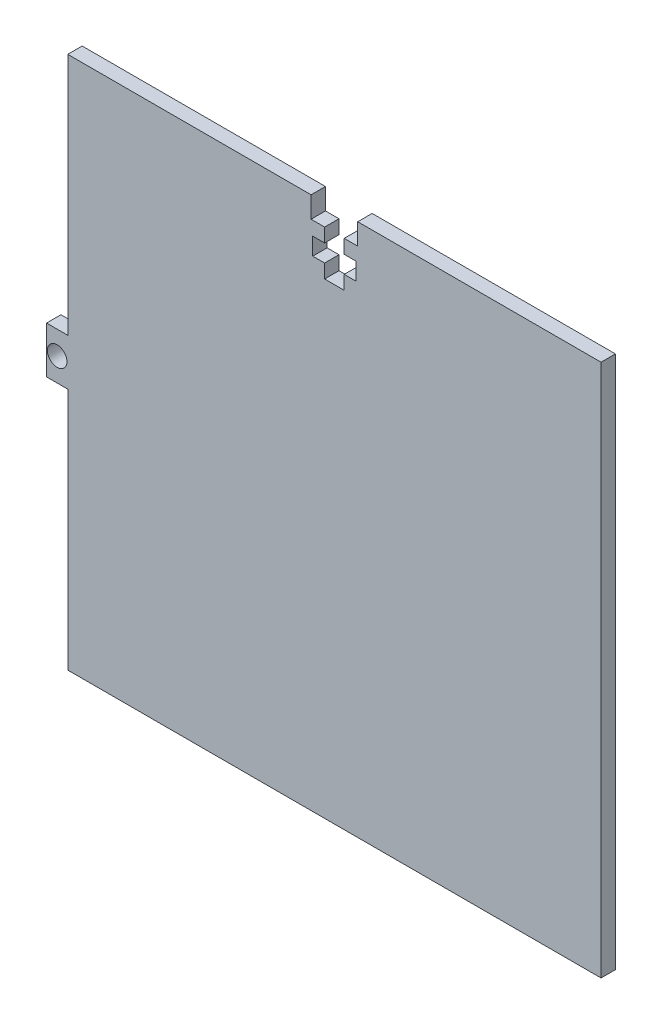
ISO-10303-21;
HEADER;
FILE_DESCRIPTION(('STEP AP214'),'2;1');
FILE_NAME('part.step','',(''),(''),'','','');
FILE_SCHEMA(('AUTOMOTIVE_DESIGN { 1 0 10303 214 1 1 1 1 }'));
ENDSEC;
DATA;
#1=APPLICATION_CONTEXT('core data for automotive mechanical design processes');
#2=APPLICATION_PROTOCOL_DEFINITION('international standard','automotive_design',2000,#1);
#3=PRODUCT_CONTEXT('',#1,'mechanical');
#4=PRODUCT('Part','Part','',(#3));
#5=PRODUCT_RELATED_PRODUCT_CATEGORY('part','',(#4));
#6=PRODUCT_DEFINITION_FORMATION('','',#4);
#7=PRODUCT_DEFINITION_CONTEXT('part definition',#1,'design');
#8=PRODUCT_DEFINITION('design','',#6,#7);
#9=PRODUCT_DEFINITION_SHAPE('','',#8);
#10=(LENGTH_UNIT() NAMED_UNIT(*) SI_UNIT(.MILLI.,.METRE.));
#11=(NAMED_UNIT(*) PLANE_ANGLE_UNIT() SI_UNIT($,.RADIAN.));
#12=(NAMED_UNIT(*) SI_UNIT($,.STERADIAN.) SOLID_ANGLE_UNIT());
#13=UNCERTAINTY_MEASURE_WITH_UNIT(LENGTH_MEASURE(1.E-05),#10,'distance_accuracy_value','');
#14=(GEOMETRIC_REPRESENTATION_CONTEXT(3) GLOBAL_UNCERTAINTY_ASSIGNED_CONTEXT((#13)) GLOBAL_UNIT_ASSIGNED_CONTEXT((#10,
#11,#12)) REPRESENTATION_CONTEXT('',''));
#15=CARTESIAN_POINT('',(0.,0.,0.));
#16=DIRECTION('',(0.,0.,1.));
#17=DIRECTION('',(1.,0.,0.));
#18=AXIS2_PLACEMENT_3D('',#15,#16,#17);
#19=CARTESIAN_POINT('',(-40.,40.,2.15880724650714));
#20=DIRECTION('',(1.,0.,0.));
#21=DIRECTION('',(0.,1.,0.));
#22=AXIS2_PLACEMENT_3D('',#19,#20,#21);
#23=PLANE('',#22);
#24=DIRECTION('',(0.,0.,1.));
#25=VECTOR('',#24,1.);
#26=CARTESIAN_POINT('',(-40.,-3.50000000000002,-7.68845888328736));
#27=LINE('',#26,#25);
#28=CARTESIAN_POINT('',(-40.,-3.50000000000002,0.));
#29=VERTEX_POINT('',#28);
#30=CARTESIAN_POINT('',(-40.,-3.50000000000002,2.15880724650714));
#31=VERTEX_POINT('',#30);
#32=EDGE_CURVE('E61',#29,#31,#27,.T.);
#33=ORIENTED_EDGE('',*,*,#32,.F.);
#34=DIRECTION('',(0.,-1.,0.));
#35=VECTOR('',#34,1.);
#36=CARTESIAN_POINT('',(-40.,40.,0.));
#37=LINE('',#36,#35);
#38=CARTESIAN_POINT('',(-40.,-40.,0.));
#39=VERTEX_POINT('',#38);
#40=EDGE_CURVE('E381',#29,#39,#37,.T.);
#41=ORIENTED_EDGE('',*,*,#40,.T.);
#42=DIRECTION('',(0.,0.,-1.));
#43=VECTOR('',#42,1.);
#44=CARTESIAN_POINT('',(-40.,-40.,2.15880724650714));
#45=LINE('',#44,#43);
#46=CARTESIAN_POINT('',(-40.,-40.,2.15880724650714));
#47=VERTEX_POINT('',#46);
#48=EDGE_CURVE('E387',#47,#39,#45,.T.);
#49=ORIENTED_EDGE('',*,*,#48,.F.);
#50=DIRECTION('',(0.,-1.,0.));
#51=VECTOR('',#50,1.);
#52=CARTESIAN_POINT('',(-40.,40.,2.15880724650714));
#53=LINE('',#52,#51);
#54=EDGE_CURVE('E370',#31,#47,#53,.T.);
#55=ORIENTED_EDGE('',*,*,#54,.F.);
#56=EDGE_LOOP('',(#33,#41,#49,#55));
#57=FACE_BOUND('',#56,.T.);
#58=ADVANCED_FACE('F38',(#57),#23,.F.);
#59=CARTESIAN_POINT('',(-3.5,36.825,0.));
#60=DIRECTION('',(0.,-1.,0.));
#61=DIRECTION('',(1.,0.,0.));
#62=AXIS2_PLACEMENT_3D('',#59,#60,#61);
#63=PLANE('',#62);
#64=DIRECTION('',(1.,0.,0.));
#65=VECTOR('',#64,1.);
#66=CARTESIAN_POINT('',(-3.5,36.825,2.15880724650714));
#67=LINE('',#66,#65);
#68=CARTESIAN_POINT('',(-3.5,36.825,2.15880724650714));
#69=VERTEX_POINT('',#68);
#70=CARTESIAN_POINT('',(-1.47,36.825,2.15880724650714));
#71=VERTEX_POINT('',#70);
#72=EDGE_CURVE('E346',#69,#71,#67,.T.);
#73=ORIENTED_EDGE('',*,*,#72,.T.);
#74=DIRECTION('',(0.,0.,1.));
#75=VECTOR('',#74,1.);
#76=CARTESIAN_POINT('',(-1.47,36.825,0.));
#77=LINE('',#76,#75);
#78=CARTESIAN_POINT('',(-1.47,36.825,0.));
#79=VERTEX_POINT('',#78);
#80=EDGE_CURVE('E305',#79,#71,#77,.T.);
#81=ORIENTED_EDGE('',*,*,#80,.F.);
#82=DIRECTION('',(1.,0.,0.));
#83=VECTOR('',#82,1.);
#84=CARTESIAN_POINT('',(-3.5,36.825,0.));
#85=LINE('',#84,#83);
#86=CARTESIAN_POINT('',(-3.5,36.825,0.));
#87=VERTEX_POINT('',#86);
#88=EDGE_CURVE('E335',#87,#79,#85,.T.);
#89=ORIENTED_EDGE('',*,*,#88,.F.);
#90=DIRECTION('',(0.,0.,1.));
#91=VECTOR('',#90,1.);
#92=CARTESIAN_POINT('',(-3.5,36.825,0.));
#93=LINE('',#92,#91);
#94=EDGE_CURVE('E341',#87,#69,#93,.T.);
#95=ORIENTED_EDGE('',*,*,#94,.T.);
#96=EDGE_LOOP('',(#73,#81,#89,#95));
#97=FACE_BOUND('',#96,.T.);
#98=ADVANCED_FACE('F472',(#97),#63,.F.);
#99=CARTESIAN_POINT('',(-40.,40.,2.15880724650714));
#100=DIRECTION('',(0.,-1.,0.));
#101=DIRECTION('',(0.,0.,-1.));
#102=AXIS2_PLACEMENT_3D('',#99,#100,#101);
#103=PLANE('',#102);
#104=DIRECTION('',(-1.,0.,0.));
#105=VECTOR('',#104,1.);
#106=CARTESIAN_POINT('',(-40.,40.,2.15880724650714));
#107=LINE('',#106,#105);
#108=CARTESIAN_POINT('',(-3.50000000000001,40.,2.15880724650714));
#109=VERTEX_POINT('',#108);
#110=CARTESIAN_POINT('',(-40.,40.,2.15880724650714));
#111=VERTEX_POINT('',#110);
#112=EDGE_CURVE('E365',#109,#111,#107,.T.);
#113=ORIENTED_EDGE('',*,*,#112,.F.);
#114=DIRECTION('',(0.,0.,1.));
#115=VECTOR('',#114,1.);
#116=CARTESIAN_POINT('',(-3.50000000000001,40.,0.));
#117=LINE('',#116,#115);
#118=CARTESIAN_POINT('',(-3.50000000000001,40.,0.));
#119=VERTEX_POINT('',#118);
#120=EDGE_CURVE('E352',#119,#109,#117,.T.);
#121=ORIENTED_EDGE('',*,*,#120,.F.);
#122=DIRECTION('',(-1.,0.,0.));
#123=VECTOR('',#122,1.);
#124=CARTESIAN_POINT('',(-40.,40.,0.));
#125=LINE('',#124,#123);
#126=CARTESIAN_POINT('',(-40.,40.,0.));
#127=VERTEX_POINT('',#126);
#128=EDGE_CURVE('E377',#119,#127,#125,.T.);
#129=ORIENTED_EDGE('',*,*,#128,.T.);
#130=DIRECTION('',(0.,0.,-1.));
#131=VECTOR('',#130,1.);
#132=CARTESIAN_POINT('',(-40.,40.,2.15880724650714));
#133=LINE('',#132,#131);
#134=EDGE_CURVE('E46',#111,#127,#133,.T.);
#135=ORIENTED_EDGE('',*,*,#134,.F.);
#136=EDGE_LOOP('',(#113,#121,#129,#135));
#137=FACE_BOUND('',#136,.T.);
#138=ADVANCED_FACE('F477',(#137),#103,.F.);
#139=CARTESIAN_POINT('',(40.,40.,2.15880724650714));
#140=DIRECTION('',(-1.,0.,0.));
#141=DIRECTION('',(0.,-1.,0.));
#142=AXIS2_PLACEMENT_3D('',#139,#140,#141);
#143=PLANE('',#142);
#144=DIRECTION('',(0.,1.,0.));
#145=VECTOR('',#144,1.);
#146=CARTESIAN_POINT('',(40.,40.,0.));
#147=LINE('',#146,#145);
#148=CARTESIAN_POINT('',(40.,-40.,0.));
#149=VERTEX_POINT('',#148);
#150=CARTESIAN_POINT('',(40.,40.,0.));
#151=VERTEX_POINT('',#150);
#152=EDGE_CURVE('E354',#149,#151,#147,.T.);
#153=ORIENTED_EDGE('',*,*,#152,.T.);
#154=DIRECTION('',(0.,0.,-1.));
#155=VECTOR('',#154,1.);
#156=CARTESIAN_POINT('',(40.,40.,2.15880724650714));
#157=LINE('',#156,#155);
#158=CARTESIAN_POINT('',(40.,40.,2.15880724650714));
#159=VERTEX_POINT('',#158);
#160=EDGE_CURVE('E11',#159,#151,#157,.T.);
#161=ORIENTED_EDGE('',*,*,#160,.F.);
#162=DIRECTION('',(0.,1.,0.));
#163=VECTOR('',#162,1.);
#164=CARTESIAN_POINT('',(40.,40.,2.15880724650714));
#165=LINE('',#164,#163);
#166=CARTESIAN_POINT('',(40.,-40.,2.15880724650714));
#167=VERTEX_POINT('',#166);
#168=EDGE_CURVE('E362',#167,#159,#165,.T.);
#169=ORIENTED_EDGE('',*,*,#168,.F.);
#170=DIRECTION('',(0.,0.,-1.));
#171=VECTOR('',#170,1.);
#172=CARTESIAN_POINT('',(40.,-40.,2.15880724650714));
#173=LINE('',#172,#171);
#174=EDGE_CURVE('E374',#167,#149,#173,.T.);
#175=ORIENTED_EDGE('',*,*,#174,.T.);
#176=EDGE_LOOP('',(#153,#161,#169,#175));
#177=FACE_BOUND('',#176,.T.);
#178=ADVANCED_FACE('F40',(#177),#143,.F.);
#179=CARTESIAN_POINT('',(3.50000000000001,40.,0.));
#180=VERTEX_POINT('',#179);
#181=EDGE_CURVE('E378',#151,#180,#125,.T.);
#182=ORIENTED_EDGE('',*,*,#181,.T.);
#183=DIRECTION('',(0.,0.,1.));
#184=VECTOR('',#183,1.);
#185=CARTESIAN_POINT('',(3.50000000000001,40.,0.));
#186=LINE('',#185,#184);
#187=CARTESIAN_POINT('',(3.50000000000001,40.,2.15880724650714));
#188=VERTEX_POINT('',#187);
#189=EDGE_CURVE('E355',#180,#188,#186,.T.);
#190=ORIENTED_EDGE('',*,*,#189,.T.);
#191=EDGE_CURVE('E367',#159,#188,#107,.T.);
#192=ORIENTED_EDGE('',*,*,#191,.F.);
#193=ORIENTED_EDGE('',*,*,#160,.T.);
#194=EDGE_LOOP('',(#182,#190,#192,#193));
#195=FACE_BOUND('',#194,.T.);
#196=ADVANCED_FACE('F418',(#195),#103,.F.);
#197=CARTESIAN_POINT('',(-40.,3.5,0.));
#198=VERTEX_POINT('',#197);
#199=EDGE_CURVE('E382',#127,#198,#37,.T.);
#200=ORIENTED_EDGE('',*,*,#199,.T.);
#201=DIRECTION('',(0.,0.,1.));
#202=VECTOR('',#201,1.);
#203=CARTESIAN_POINT('',(-40.,3.5,-7.68845888328736));
#204=LINE('',#203,#202);
#205=CARTESIAN_POINT('',(-40.,3.5,2.15880724650714));
#206=VERTEX_POINT('',#205);
#207=EDGE_CURVE('E53',#198,#206,#204,.T.);
#208=ORIENTED_EDGE('',*,*,#207,.T.);
#209=EDGE_CURVE('E224',#111,#206,#53,.T.);
#210=ORIENTED_EDGE('',*,*,#209,.F.);
#211=ORIENTED_EDGE('',*,*,#134,.T.);
#212=EDGE_LOOP('',(#200,#208,#210,#211));
#213=FACE_BOUND('',#212,.T.);
#214=ADVANCED_FACE('F392',(#213),#23,.F.);
#215=CARTESIAN_POINT('',(-40.,-40.,2.15880724650714));
#216=DIRECTION('',(0.,1.,0.));
#217=DIRECTION('',(0.,0.,1.));
#218=AXIS2_PLACEMENT_3D('',#215,#216,#217);
#219=PLANE('',#218);
#220=DIRECTION('',(1.,0.,0.));
#221=VECTOR('',#220,1.);
#222=CARTESIAN_POINT('',(-40.,-40.,0.));
#223=LINE('',#222,#221);
#224=EDGE_CURVE('E366',#39,#149,#223,.T.);
#225=ORIENTED_EDGE('',*,*,#224,.T.);
#226=ORIENTED_EDGE('',*,*,#174,.F.);
#227=DIRECTION('',(1.,0.,0.));
#228=VECTOR('',#227,1.);
#229=CARTESIAN_POINT('',(-40.,-40.,2.15880724650714));
#230=LINE('',#229,#228);
#231=EDGE_CURVE('E372',#47,#167,#230,.T.);
#232=ORIENTED_EDGE('',*,*,#231,.F.);
#233=ORIENTED_EDGE('',*,*,#48,.T.);
#234=EDGE_LOOP('',(#225,#226,#232,#233));
#235=FACE_BOUND('',#234,.T.);
#236=ADVANCED_FACE('F410',(#235),#219,.F.);
#237=CARTESIAN_POINT('',(0.,0.,2.15880724650714));
#238=DIRECTION('',(0.,0.,1.));
#239=DIRECTION('',(1.,0.,0.));
#240=AXIS2_PLACEMENT_3D('',#237,#238,#239);
#241=PLANE('',#240);
#242=DIRECTION('',(0.,-1.,0.));
#243=VECTOR('',#242,1.);
#244=CARTESIAN_POINT('',(-1.47,36.825,2.15880724650714));
#245=LINE('',#244,#243);
#246=CARTESIAN_POINT('',(-1.47,34.75,2.15880724650714));
#247=VERTEX_POINT('',#246);
#248=EDGE_CURVE('E239',#71,#247,#245,.T.);
#249=ORIENTED_EDGE('',*,*,#248,.F.);
#250=ORIENTED_EDGE('',*,*,#72,.F.);
#251=DIRECTION('',(0.,-1.,0.));
#252=VECTOR('',#251,1.);
#253=CARTESIAN_POINT('',(-3.50000000000001,40.,2.15880724650714));
#254=LINE('',#253,#252);
#255=EDGE_CURVE('E307',#109,#69,#254,.T.);
#256=ORIENTED_EDGE('',*,*,#255,.F.);
#257=ORIENTED_EDGE('',*,*,#112,.T.);
#258=ORIENTED_EDGE('',*,*,#209,.T.);
#259=DIRECTION('',(-1.,0.,0.));
#260=VECTOR('',#259,1.);
#261=CARTESIAN_POINT('',(-40.,3.5,2.15880724650714));
#262=LINE('',#261,#260);
#263=CARTESIAN_POINT('',(-43.18,3.5,2.15880724650714));
#264=VERTEX_POINT('',#263);
#265=EDGE_CURVE('E205',#206,#264,#262,.T.);
#266=ORIENTED_EDGE('',*,*,#265,.T.);
#267=DIRECTION('',(0.,-1.,0.));
#268=VECTOR('',#267,1.);
#269=CARTESIAN_POINT('',(-43.18,3.5,2.15880724650714));
#270=LINE('',#269,#268);
#271=CARTESIAN_POINT('',(-43.18,-3.5,2.15880724650714));
#272=VERTEX_POINT('',#271);
#273=EDGE_CURVE('E213',#264,#272,#270,.T.);
#274=ORIENTED_EDGE('',*,*,#273,.T.);
#275=DIRECTION('',(1.,0.,0.));
#276=VECTOR('',#275,1.);
#277=CARTESIAN_POINT('',(-40.,-3.50000000000002,2.15880724650714));
#278=LINE('',#277,#276);
#279=EDGE_CURVE('E219',#272,#31,#278,.T.);
#280=ORIENTED_EDGE('',*,*,#279,.T.);
#281=ORIENTED_EDGE('',*,*,#54,.T.);
#282=ORIENTED_EDGE('',*,*,#231,.T.);
#283=ORIENTED_EDGE('',*,*,#168,.T.);
#284=ORIENTED_EDGE('',*,*,#191,.T.);
#285=DIRECTION('',(0.,1.,0.));
#286=VECTOR('',#285,1.);
#287=CARTESIAN_POINT('',(3.50000000000001,40.,2.15880724650714));
#288=LINE('',#287,#286);
#289=CARTESIAN_POINT('',(3.5,36.825,2.15880724650714));
#290=VERTEX_POINT('',#289);
#291=EDGE_CURVE('E334',#290,#188,#288,.T.);
#292=ORIENTED_EDGE('',*,*,#291,.F.);
#293=CARTESIAN_POINT('',(1.47,36.825,2.15880724650714));
#294=VERTEX_POINT('',#293);
#295=EDGE_CURVE('E345',#294,#290,#67,.T.);
#296=ORIENTED_EDGE('',*,*,#295,.F.);
#297=DIRECTION('',(0.,1.,0.));
#298=VECTOR('',#297,1.);
#299=CARTESIAN_POINT('',(1.47,36.825,2.15880724650714));
#300=LINE('',#299,#298);
#301=CARTESIAN_POINT('',(1.47,34.75,2.15880724650714));
#302=VERTEX_POINT('',#301);
#303=EDGE_CURVE('E244',#302,#294,#300,.T.);
#304=ORIENTED_EDGE('',*,*,#303,.F.);
#305=DIRECTION('',(-1.,0.,0.));
#306=VECTOR('',#305,1.);
#307=CARTESIAN_POINT('',(1.47,34.75,2.15880724650714));
#308=LINE('',#307,#306);
#309=CARTESIAN_POINT('',(3.25,34.75,2.15880724650714));
#310=VERTEX_POINT('',#309);
#311=EDGE_CURVE('E301',#310,#302,#308,.T.);
#312=ORIENTED_EDGE('',*,*,#311,.F.);
#313=DIRECTION('',(0.,1.,0.));
#314=VECTOR('',#313,1.);
#315=CARTESIAN_POINT('',(3.25,34.75,2.15880724650714));
#316=LINE('',#315,#314);
#317=CARTESIAN_POINT('',(3.25,32.15,2.15880724650714));
#318=VERTEX_POINT('',#317);
#319=EDGE_CURVE('E298',#318,#310,#316,.T.);
#320=ORIENTED_EDGE('',*,*,#319,.F.);
#321=DIRECTION('',(1.,0.,0.));
#322=VECTOR('',#321,1.);
#323=CARTESIAN_POINT('',(1.47,32.15,2.15880724650714));
#324=LINE('',#323,#322);
#325=CARTESIAN_POINT('',(1.47,32.15,2.15880724650714));
#326=VERTEX_POINT('',#325);
#327=EDGE_CURVE('E295',#326,#318,#324,.T.);
#328=ORIENTED_EDGE('',*,*,#327,.F.);
#329=DIRECTION('',(0.,1.,0.));
#330=VECTOR('',#329,1.);
#331=CARTESIAN_POINT('',(1.47,32.15,2.15880724650714));
#332=LINE('',#331,#330);
#333=CARTESIAN_POINT('',(1.47,30.075,2.15880724650714));
#334=VERTEX_POINT('',#333);
#335=EDGE_CURVE('E292',#334,#326,#332,.T.);
#336=ORIENTED_EDGE('',*,*,#335,.F.);
#337=DIRECTION('',(1.,0.,0.));
#338=VECTOR('',#337,1.);
#339=CARTESIAN_POINT('',(-1.47,30.075,2.15880724650714));
#340=LINE('',#339,#338);
#341=CARTESIAN_POINT('',(-1.47,30.075,2.15880724650714));
#342=VERTEX_POINT('',#341);
#343=EDGE_CURVE('E289',#342,#334,#340,.T.);
#344=ORIENTED_EDGE('',*,*,#343,.F.);
#345=DIRECTION('',(0.,-1.,0.));
#346=VECTOR('',#345,1.);
#347=CARTESIAN_POINT('',(-1.47,32.15,2.15880724650714));
#348=LINE('',#347,#346);
#349=CARTESIAN_POINT('',(-1.47,32.15,2.15880724650714));
#350=VERTEX_POINT('',#349);
#351=EDGE_CURVE('E286',#350,#342,#348,.T.);
#352=ORIENTED_EDGE('',*,*,#351,.F.);
#353=DIRECTION('',(1.,0.,0.));
#354=VECTOR('',#353,1.);
#355=CARTESIAN_POINT('',(-3.25,32.15,2.15880724650714));
#356=LINE('',#355,#354);
#357=CARTESIAN_POINT('',(-3.25,32.15,2.15880724650714));
#358=VERTEX_POINT('',#357);
#359=EDGE_CURVE('E283',#358,#350,#356,.T.);
#360=ORIENTED_EDGE('',*,*,#359,.F.);
#361=DIRECTION('',(0.,-1.,0.));
#362=VECTOR('',#361,1.);
#363=CARTESIAN_POINT('',(-3.25,34.75,2.15880724650714));
#364=LINE('',#363,#362);
#365=CARTESIAN_POINT('',(-3.25,34.75,2.15880724650714));
#366=VERTEX_POINT('',#365);
#367=EDGE_CURVE('E280',#366,#358,#364,.T.);
#368=ORIENTED_EDGE('',*,*,#367,.F.);
#369=DIRECTION('',(-1.,0.,0.));
#370=VECTOR('',#369,1.);
#371=CARTESIAN_POINT('',(-3.25,34.75,2.15880724650714));
#372=LINE('',#371,#370);
#373=EDGE_CURVE('E277',#247,#366,#372,.T.);
#374=ORIENTED_EDGE('',*,*,#373,.F.);
#375=EDGE_LOOP('',(#249,#250,#256,#257,#258,#266,#274,#280,#281,#282,#283,#284,#292,#296,#304,
#312,#320,#328,#336,#344,#352,#360,#368,#374));
#376=FACE_BOUND('',#375,.T.);
#377=CARTESIAN_POINT('',(-41.59,0.,2.15880724650714));
#378=DIRECTION('',(0.,0.,1.));
#379=DIRECTION('',(1.,0.,0.));
#380=AXIS2_PLACEMENT_3D('',#377,#378,#379);
#381=CIRCLE('',#380,1.47);
#382=CARTESIAN_POINT('',(-40.12,0.,2.15880724650714));
#383=VERTEX_POINT('',#382);
#384=EDGE_CURVE('E225',#383,#383,#381,.T.);
#385=ORIENTED_EDGE('',*,*,#384,.F.);
#386=EDGE_LOOP('',(#385));
#387=FACE_BOUND('',#386,.T.);
#388=ADVANCED_FACE('F222',(#376,#387),#241,.T.);
#389=CARTESIAN_POINT('',(0.,0.,0.));
#390=DIRECTION('',(0.,0.,1.));
#391=DIRECTION('',(1.,0.,0.));
#392=AXIS2_PLACEMENT_3D('',#389,#390,#391);
#393=PLANE('',#392);
#394=ORIENTED_EDGE('',*,*,#88,.T.);
#395=DIRECTION('',(0.,-1.,0.));
#396=VECTOR('',#395,1.);
#397=CARTESIAN_POINT('',(-1.47,36.825,0.));
#398=LINE('',#397,#396);
#399=CARTESIAN_POINT('',(-1.47,34.75,0.));
#400=VERTEX_POINT('',#399);
#401=EDGE_CURVE('E240',#79,#400,#398,.T.);
#402=ORIENTED_EDGE('',*,*,#401,.T.);
#403=DIRECTION('',(-1.,0.,0.));
#404=VECTOR('',#403,1.);
#405=CARTESIAN_POINT('',(-3.25,34.75,0.));
#406=LINE('',#405,#404);
#407=CARTESIAN_POINT('',(-3.25,34.75,0.));
#408=VERTEX_POINT('',#407);
#409=EDGE_CURVE('E243',#400,#408,#406,.T.);
#410=ORIENTED_EDGE('',*,*,#409,.T.);
#411=DIRECTION('',(0.,-1.,0.));
#412=VECTOR('',#411,1.);
#413=CARTESIAN_POINT('',(-3.25,34.75,0.));
#414=LINE('',#413,#412);
#415=CARTESIAN_POINT('',(-3.25,32.15,0.));
#416=VERTEX_POINT('',#415);
#417=EDGE_CURVE('E247',#408,#416,#414,.T.);
#418=ORIENTED_EDGE('',*,*,#417,.T.);
#419=DIRECTION('',(1.,0.,0.));
#420=VECTOR('',#419,1.);
#421=CARTESIAN_POINT('',(-3.25,32.15,0.));
#422=LINE('',#421,#420);
#423=CARTESIAN_POINT('',(-1.47,32.15,0.));
#424=VERTEX_POINT('',#423);
#425=EDGE_CURVE('E250',#416,#424,#422,.T.);
#426=ORIENTED_EDGE('',*,*,#425,.T.);
#427=DIRECTION('',(0.,-1.,0.));
#428=VECTOR('',#427,1.);
#429=CARTESIAN_POINT('',(-1.47,32.15,0.));
#430=LINE('',#429,#428);
#431=CARTESIAN_POINT('',(-1.47,30.075,0.));
#432=VERTEX_POINT('',#431);
#433=EDGE_CURVE('E253',#424,#432,#430,.T.);
#434=ORIENTED_EDGE('',*,*,#433,.T.);
#435=DIRECTION('',(1.,0.,0.));
#436=VECTOR('',#435,1.);
#437=CARTESIAN_POINT('',(-1.47,30.075,0.));
#438=LINE('',#437,#436);
#439=CARTESIAN_POINT('',(1.47,30.075,0.));
#440=VERTEX_POINT('',#439);
#441=EDGE_CURVE('E256',#432,#440,#438,.T.);
#442=ORIENTED_EDGE('',*,*,#441,.T.);
#443=DIRECTION('',(0.,1.,0.));
#444=VECTOR('',#443,1.);
#445=CARTESIAN_POINT('',(1.47,32.15,0.));
#446=LINE('',#445,#444);
#447=CARTESIAN_POINT('',(1.47,32.15,0.));
#448=VERTEX_POINT('',#447);
#449=EDGE_CURVE('E259',#440,#448,#446,.T.);
#450=ORIENTED_EDGE('',*,*,#449,.T.);
#451=DIRECTION('',(1.,0.,0.));
#452=VECTOR('',#451,1.);
#453=CARTESIAN_POINT('',(1.47,32.15,0.));
#454=LINE('',#453,#452);
#455=CARTESIAN_POINT('',(3.25,32.15,0.));
#456=VERTEX_POINT('',#455);
#457=EDGE_CURVE('E262',#448,#456,#454,.T.);
#458=ORIENTED_EDGE('',*,*,#457,.T.);
#459=DIRECTION('',(0.,1.,0.));
#460=VECTOR('',#459,1.);
#461=CARTESIAN_POINT('',(3.25,34.75,0.));
#462=LINE('',#461,#460);
#463=CARTESIAN_POINT('',(3.25,34.75,0.));
#464=VERTEX_POINT('',#463);
#465=EDGE_CURVE('E265',#456,#464,#462,.T.);
#466=ORIENTED_EDGE('',*,*,#465,.T.);
#467=DIRECTION('',(-1.,0.,0.));
#468=VECTOR('',#467,1.);
#469=CARTESIAN_POINT('',(1.47,34.75,0.));
#470=LINE('',#469,#468);
#471=CARTESIAN_POINT('',(1.47,34.75,0.));
#472=VERTEX_POINT('',#471);
#473=EDGE_CURVE('E268',#464,#472,#470,.T.);
#474=ORIENTED_EDGE('',*,*,#473,.T.);
#475=DIRECTION('',(0.,1.,0.));
#476=VECTOR('',#475,1.);
#477=CARTESIAN_POINT('',(1.47,36.825,0.));
#478=LINE('',#477,#476);
#479=CARTESIAN_POINT('',(1.47,36.825,0.));
#480=VERTEX_POINT('',#479);
#481=EDGE_CURVE('E271',#472,#480,#478,.T.);
#482=ORIENTED_EDGE('',*,*,#481,.T.);
#483=CARTESIAN_POINT('',(3.5,36.825,0.));
#484=VERTEX_POINT('',#483);
#485=EDGE_CURVE('E333',#480,#484,#85,.T.);
#486=ORIENTED_EDGE('',*,*,#485,.T.);
#487=DIRECTION('',(0.,1.,0.));
#488=VECTOR('',#487,1.);
#489=CARTESIAN_POINT('',(3.50000000000001,40.,0.));
#490=LINE('',#489,#488);
#491=EDGE_CURVE('E338',#484,#180,#490,.T.);
#492=ORIENTED_EDGE('',*,*,#491,.T.);
#493=ORIENTED_EDGE('',*,*,#181,.F.);
#494=ORIENTED_EDGE('',*,*,#152,.F.);
#495=ORIENTED_EDGE('',*,*,#224,.F.);
#496=ORIENTED_EDGE('',*,*,#40,.F.);
#497=DIRECTION('',(-1.,0.,0.));
#498=VECTOR('',#497,1.);
#499=CARTESIAN_POINT('',(-40.,-3.50000000000002,0.));
#500=LINE('',#499,#498);
#501=CARTESIAN_POINT('',(-43.18,-3.5,0.));
#502=VERTEX_POINT('',#501);
#503=EDGE_CURVE('E399',#29,#502,#500,.T.);
#504=ORIENTED_EDGE('',*,*,#503,.T.);
#505=DIRECTION('',(0.,1.,0.));
#506=VECTOR('',#505,1.);
#507=CARTESIAN_POINT('',(-43.18,3.5,0.));
#508=LINE('',#507,#506);
#509=CARTESIAN_POINT('',(-43.18,3.5,0.));
#510=VERTEX_POINT('',#509);
#511=EDGE_CURVE('E233',#502,#510,#508,.T.);
#512=ORIENTED_EDGE('',*,*,#511,.T.);
#513=DIRECTION('',(1.,0.,0.));
#514=VECTOR('',#513,1.);
#515=CARTESIAN_POINT('',(-40.,3.5,0.));
#516=LINE('',#515,#514);
#517=EDGE_CURVE('E207',#510,#198,#516,.T.);
#518=ORIENTED_EDGE('',*,*,#517,.T.);
#519=ORIENTED_EDGE('',*,*,#199,.F.);
#520=ORIENTED_EDGE('',*,*,#128,.F.);
#521=DIRECTION('',(0.,-1.,0.));
#522=VECTOR('',#521,1.);
#523=CARTESIAN_POINT('',(-3.50000000000001,40.,0.));
#524=LINE('',#523,#522);
#525=EDGE_CURVE('E330',#119,#87,#524,.T.);
#526=ORIENTED_EDGE('',*,*,#525,.T.);
#527=EDGE_LOOP('',(#394,#402,#410,#418,#426,#434,#442,#450,#458,#466,#474,#482,#486,#492,#493,
#494,#495,#496,#504,#512,#518,#519,#520,#526));
#528=FACE_BOUND('',#527,.T.);
#529=CARTESIAN_POINT('',(-41.59,0.,0.));
#530=DIRECTION('',(0.,0.,1.));
#531=DIRECTION('',(1.,0.,0.));
#532=AXIS2_PLACEMENT_3D('',#529,#530,#531);
#533=CIRCLE('',#532,1.47);
#534=CARTESIAN_POINT('',(-40.12,0.,0.));
#535=VERTEX_POINT('',#534);
#536=EDGE_CURVE('E236',#535,#535,#533,.F.);
#537=ORIENTED_EDGE('',*,*,#536,.F.);
#538=EDGE_LOOP('',(#537));
#539=FACE_BOUND('',#538,.T.);
#540=ADVANCED_FACE('F397',(#528,#539),#393,.F.);
#541=CARTESIAN_POINT('',(-3.50000000000001,40.,0.));
#542=DIRECTION('',(-1.,0.,0.));
#543=DIRECTION('',(0.,-1.,0.));
#544=AXIS2_PLACEMENT_3D('',#541,#542,#543);
#545=PLANE('',#544);
#546=ORIENTED_EDGE('',*,*,#255,.T.);
#547=ORIENTED_EDGE('',*,*,#94,.F.);
#548=ORIENTED_EDGE('',*,*,#525,.F.);
#549=ORIENTED_EDGE('',*,*,#120,.T.);
#550=EDGE_LOOP('',(#546,#547,#548,#549));
#551=FACE_BOUND('',#550,.T.);
#552=ADVANCED_FACE('F475',(#551),#545,.F.);
#553=CARTESIAN_POINT('',(3.50000000000001,40.,0.));
#554=DIRECTION('',(1.,0.,0.));
#555=DIRECTION('',(0.,1.,0.));
#556=AXIS2_PLACEMENT_3D('',#553,#554,#555);
#557=PLANE('',#556);
#558=ORIENTED_EDGE('',*,*,#291,.T.);
#559=ORIENTED_EDGE('',*,*,#189,.F.);
#560=ORIENTED_EDGE('',*,*,#491,.F.);
#561=DIRECTION('',(0.,0.,1.));
#562=VECTOR('',#561,1.);
#563=CARTESIAN_POINT('',(3.5,36.825,0.));
#564=LINE('',#563,#562);
#565=EDGE_CURVE('E358',#484,#290,#564,.T.);
#566=ORIENTED_EDGE('',*,*,#565,.T.);
#567=EDGE_LOOP('',(#558,#559,#560,#566));
#568=FACE_BOUND('',#567,.T.);
#569=ADVANCED_FACE('F421',(#568),#557,.F.);
#570=ORIENTED_EDGE('',*,*,#485,.F.);
#571=DIRECTION('',(0.,0.,1.));
#572=VECTOR('',#571,1.);
#573=CARTESIAN_POINT('',(1.47,36.825,0.));
#574=LINE('',#573,#572);
#575=EDGE_CURVE('E308',#480,#294,#574,.T.);
#576=ORIENTED_EDGE('',*,*,#575,.T.);
#577=ORIENTED_EDGE('',*,*,#295,.T.);
#578=ORIENTED_EDGE('',*,*,#565,.F.);
#579=EDGE_LOOP('',(#570,#576,#577,#578));
#580=FACE_BOUND('',#579,.T.);
#581=ADVANCED_FACE('F426',(#580),#63,.F.);
#582=CARTESIAN_POINT('',(-1.47,36.825,0.));
#583=DIRECTION('',(-1.,0.,0.));
#584=DIRECTION('',(0.,0.,1.));
#585=AXIS2_PLACEMENT_3D('',#582,#583,#584);
#586=PLANE('',#585);
#587=ORIENTED_EDGE('',*,*,#248,.T.);
#588=DIRECTION('',(0.,0.,1.));
#589=VECTOR('',#588,1.);
#590=CARTESIAN_POINT('',(-1.47,34.75,0.));
#591=LINE('',#590,#589);
#592=EDGE_CURVE('E274',#400,#247,#591,.T.);
#593=ORIENTED_EDGE('',*,*,#592,.F.);
#594=ORIENTED_EDGE('',*,*,#401,.F.);
#595=ORIENTED_EDGE('',*,*,#80,.T.);
#596=EDGE_LOOP('',(#587,#593,#594,#595));
#597=FACE_BOUND('',#596,.T.);
#598=ADVANCED_FACE('F468',(#597),#586,.F.);
#599=CARTESIAN_POINT('',(1.47,36.825,0.));
#600=DIRECTION('',(1.,0.,0.));
#601=DIRECTION('',(0.,0.,-1.));
#602=AXIS2_PLACEMENT_3D('',#599,#600,#601);
#603=PLANE('',#602);
#604=ORIENTED_EDGE('',*,*,#303,.T.);
#605=ORIENTED_EDGE('',*,*,#575,.F.);
#606=ORIENTED_EDGE('',*,*,#481,.F.);
#607=DIRECTION('',(0.,0.,1.));
#608=VECTOR('',#607,1.);
#609=CARTESIAN_POINT('',(1.47,34.75,0.));
#610=LINE('',#609,#608);
#611=EDGE_CURVE('E311',#472,#302,#610,.T.);
#612=ORIENTED_EDGE('',*,*,#611,.T.);
#613=EDGE_LOOP('',(#604,#605,#606,#612));
#614=FACE_BOUND('',#613,.T.);
#615=ADVANCED_FACE('F431',(#614),#603,.F.);
#616=CARTESIAN_POINT('',(1.47,34.75,0.));
#617=DIRECTION('',(0.,1.,0.));
#618=DIRECTION('',(0.,0.,1.));
#619=AXIS2_PLACEMENT_3D('',#616,#617,#618);
#620=PLANE('',#619);
#621=ORIENTED_EDGE('',*,*,#311,.T.);
#622=ORIENTED_EDGE('',*,*,#611,.F.);
#623=ORIENTED_EDGE('',*,*,#473,.F.);
#624=DIRECTION('',(0.,0.,1.));
#625=VECTOR('',#624,1.);
#626=CARTESIAN_POINT('',(3.25,34.75,0.));
#627=LINE('',#626,#625);
#628=EDGE_CURVE('E313',#464,#310,#627,.T.);
#629=ORIENTED_EDGE('',*,*,#628,.T.);
#630=EDGE_LOOP('',(#621,#622,#623,#629));
#631=FACE_BOUND('',#630,.T.);
#632=ADVANCED_FACE('F434',(#631),#620,.F.);
#633=CARTESIAN_POINT('',(3.25,34.75,0.));
#634=DIRECTION('',(1.,0.,0.));
#635=DIRECTION('',(0.,1.,0.));
#636=AXIS2_PLACEMENT_3D('',#633,#634,#635);
#637=PLANE('',#636);
#638=ORIENTED_EDGE('',*,*,#319,.T.);
#639=ORIENTED_EDGE('',*,*,#628,.F.);
#640=ORIENTED_EDGE('',*,*,#465,.F.);
#641=DIRECTION('',(0.,0.,1.));
#642=VECTOR('',#641,1.);
#643=CARTESIAN_POINT('',(3.25,32.15,0.));
#644=LINE('',#643,#642);
#645=EDGE_CURVE('E315',#456,#318,#644,.T.);
#646=ORIENTED_EDGE('',*,*,#645,.T.);
#647=EDGE_LOOP('',(#638,#639,#640,#646));
#648=FACE_BOUND('',#647,.T.);
#649=ADVANCED_FACE('F437',(#648),#637,.F.);
#650=CARTESIAN_POINT('',(1.47,32.15,0.));
#651=DIRECTION('',(0.,-1.,0.));
#652=DIRECTION('',(0.,0.,-1.));
#653=AXIS2_PLACEMENT_3D('',#650,#651,#652);
#654=PLANE('',#653);
#655=ORIENTED_EDGE('',*,*,#327,.T.);
#656=ORIENTED_EDGE('',*,*,#645,.F.);
#657=ORIENTED_EDGE('',*,*,#457,.F.);
#658=DIRECTION('',(0.,0.,1.));
#659=VECTOR('',#658,1.);
#660=CARTESIAN_POINT('',(1.47,32.15,0.));
#661=LINE('',#660,#659);
#662=EDGE_CURVE('E317',#448,#326,#661,.T.);
#663=ORIENTED_EDGE('',*,*,#662,.T.);
#664=EDGE_LOOP('',(#655,#656,#657,#663));
#665=FACE_BOUND('',#664,.T.);
#666=ADVANCED_FACE('F442',(#665),#654,.F.);
#667=CARTESIAN_POINT('',(1.47,32.15,0.));
#668=DIRECTION('',(1.,0.,0.));
#669=DIRECTION('',(0.,0.,-1.));
#670=AXIS2_PLACEMENT_3D('',#667,#668,#669);
#671=PLANE('',#670);
#672=ORIENTED_EDGE('',*,*,#335,.T.);
#673=ORIENTED_EDGE('',*,*,#662,.F.);
#674=ORIENTED_EDGE('',*,*,#449,.F.);
#675=DIRECTION('',(0.,0.,1.));
#676=VECTOR('',#675,1.);
#677=CARTESIAN_POINT('',(1.47,30.075,0.));
#678=LINE('',#677,#676);
#679=EDGE_CURVE('E319',#440,#334,#678,.T.);
#680=ORIENTED_EDGE('',*,*,#679,.T.);
#681=EDGE_LOOP('',(#672,#673,#674,#680));
#682=FACE_BOUND('',#681,.T.);
#683=ADVANCED_FACE('F446',(#682),#671,.F.);
#684=CARTESIAN_POINT('',(-1.47,30.075,0.));
#685=DIRECTION('',(0.,-1.,0.));
#686=DIRECTION('',(0.,0.,-1.));
#687=AXIS2_PLACEMENT_3D('',#684,#685,#686);
#688=PLANE('',#687);
#689=ORIENTED_EDGE('',*,*,#343,.T.);
#690=ORIENTED_EDGE('',*,*,#679,.F.);
#691=ORIENTED_EDGE('',*,*,#441,.F.);
#692=DIRECTION('',(0.,0.,1.));
#693=VECTOR('',#692,1.);
#694=CARTESIAN_POINT('',(-1.47,30.075,0.));
#695=LINE('',#694,#693);
#696=EDGE_CURVE('E321',#432,#342,#695,.T.);
#697=ORIENTED_EDGE('',*,*,#696,.T.);
#698=EDGE_LOOP('',(#689,#690,#691,#697));
#699=FACE_BOUND('',#698,.T.);
#700=ADVANCED_FACE('F449',(#699),#688,.F.);
#701=CARTESIAN_POINT('',(-1.47,32.15,0.));
#702=DIRECTION('',(-1.,0.,0.));
#703=DIRECTION('',(0.,0.,1.));
#704=AXIS2_PLACEMENT_3D('',#701,#702,#703);
#705=PLANE('',#704);
#706=ORIENTED_EDGE('',*,*,#351,.T.);
#707=ORIENTED_EDGE('',*,*,#696,.F.);
#708=ORIENTED_EDGE('',*,*,#433,.F.);
#709=DIRECTION('',(0.,0.,1.));
#710=VECTOR('',#709,1.);
#711=CARTESIAN_POINT('',(-1.47,32.15,0.));
#712=LINE('',#711,#710);
#713=EDGE_CURVE('E323',#424,#350,#712,.T.);
#714=ORIENTED_EDGE('',*,*,#713,.T.);
#715=EDGE_LOOP('',(#706,#707,#708,#714));
#716=FACE_BOUND('',#715,.T.);
#717=ADVANCED_FACE('F454',(#716),#705,.F.);
#718=CARTESIAN_POINT('',(-3.25,32.15,0.));
#719=DIRECTION('',(0.,-1.,0.));
#720=DIRECTION('',(0.,0.,-1.));
#721=AXIS2_PLACEMENT_3D('',#718,#719,#720);
#722=PLANE('',#721);
#723=ORIENTED_EDGE('',*,*,#359,.T.);
#724=ORIENTED_EDGE('',*,*,#713,.F.);
#725=ORIENTED_EDGE('',*,*,#425,.F.);
#726=DIRECTION('',(0.,0.,1.));
#727=VECTOR('',#726,1.);
#728=CARTESIAN_POINT('',(-3.25,32.15,0.));
#729=LINE('',#728,#727);
#730=EDGE_CURVE('E325',#416,#358,#729,.T.);
#731=ORIENTED_EDGE('',*,*,#730,.T.);
#732=EDGE_LOOP('',(#723,#724,#725,#731));
#733=FACE_BOUND('',#732,.T.);
#734=ADVANCED_FACE('F458',(#733),#722,.F.);
#735=CARTESIAN_POINT('',(-3.25,34.75,0.));
#736=DIRECTION('',(-1.,0.,0.));
#737=DIRECTION('',(0.,-1.,0.));
#738=AXIS2_PLACEMENT_3D('',#735,#736,#737);
#739=PLANE('',#738);
#740=ORIENTED_EDGE('',*,*,#367,.T.);
#741=ORIENTED_EDGE('',*,*,#730,.F.);
#742=ORIENTED_EDGE('',*,*,#417,.F.);
#743=DIRECTION('',(0.,0.,1.));
#744=VECTOR('',#743,1.);
#745=CARTESIAN_POINT('',(-3.25,34.75,0.));
#746=LINE('',#745,#744);
#747=EDGE_CURVE('E327',#408,#366,#746,.T.);
#748=ORIENTED_EDGE('',*,*,#747,.T.);
#749=EDGE_LOOP('',(#740,#741,#742,#748));
#750=FACE_BOUND('',#749,.T.);
#751=ADVANCED_FACE('F461',(#750),#739,.F.);
#752=CARTESIAN_POINT('',(-3.25,34.75,0.));
#753=DIRECTION('',(0.,1.,0.));
#754=DIRECTION('',(0.,0.,1.));
#755=AXIS2_PLACEMENT_3D('',#752,#753,#754);
#756=PLANE('',#755);
#757=ORIENTED_EDGE('',*,*,#373,.T.);
#758=ORIENTED_EDGE('',*,*,#747,.F.);
#759=ORIENTED_EDGE('',*,*,#409,.F.);
#760=ORIENTED_EDGE('',*,*,#592,.T.);
#761=EDGE_LOOP('',(#757,#758,#759,#760));
#762=FACE_BOUND('',#761,.T.);
#763=ADVANCED_FACE('F465',(#762),#756,.F.);
#764=CARTESIAN_POINT('',(-40.,3.5,-7.68845888328736));
#765=DIRECTION('',(0.,1.,0.));
#766=DIRECTION('',(-1.,0.,0.));
#767=AXIS2_PLACEMENT_3D('',#764,#765,#766);
#768=PLANE('',#767);
#769=ORIENTED_EDGE('',*,*,#517,.F.);
#770=DIRECTION('',(0.,0.,1.));
#771=VECTOR('',#770,1.);
#772=CARTESIAN_POINT('',(-43.18,3.5,-7.68845888328736));
#773=LINE('',#772,#771);
#774=EDGE_CURVE('E201',#510,#264,#773,.T.);
#775=ORIENTED_EDGE('',*,*,#774,.T.);
#776=ORIENTED_EDGE('',*,*,#265,.F.);
#777=ORIENTED_EDGE('',*,*,#207,.F.);
#778=EDGE_LOOP('',(#769,#775,#776,#777));
#779=FACE_BOUND('',#778,.T.);
#780=ADVANCED_FACE('F203',(#779),#768,.T.);
#781=CARTESIAN_POINT('',(-43.18,3.5,-7.68845888328736));
#782=DIRECTION('',(-1.,0.,0.));
#783=DIRECTION('',(0.,0.,1.));
#784=AXIS2_PLACEMENT_3D('',#781,#782,#783);
#785=PLANE('',#784);
#786=ORIENTED_EDGE('',*,*,#511,.F.);
#787=DIRECTION('',(0.,0.,1.));
#788=VECTOR('',#787,1.);
#789=CARTESIAN_POINT('',(-43.18,-3.5,-7.68845888328736));
#790=LINE('',#789,#788);
#791=EDGE_CURVE('E210',#502,#272,#790,.T.);
#792=ORIENTED_EDGE('',*,*,#791,.T.);
#793=ORIENTED_EDGE('',*,*,#273,.F.);
#794=ORIENTED_EDGE('',*,*,#774,.F.);
#795=EDGE_LOOP('',(#786,#792,#793,#794));
#796=FACE_BOUND('',#795,.T.);
#797=ADVANCED_FACE('F214',(#796),#785,.T.);
#798=CARTESIAN_POINT('',(-40.,-3.50000000000002,-7.68845888328736));
#799=DIRECTION('',(0.,-1.,0.));
#800=DIRECTION('',(1.,0.,0.));
#801=AXIS2_PLACEMENT_3D('',#798,#799,#800);
#802=PLANE('',#801);
#803=ORIENTED_EDGE('',*,*,#503,.F.);
#804=ORIENTED_EDGE('',*,*,#32,.T.);
#805=ORIENTED_EDGE('',*,*,#279,.F.);
#806=ORIENTED_EDGE('',*,*,#791,.F.);
#807=EDGE_LOOP('',(#803,#804,#805,#806));
#808=FACE_BOUND('',#807,.T.);
#809=ADVANCED_FACE('F405',(#808),#802,.T.);
#810=CARTESIAN_POINT('',(-41.59,0.,-7.68845888328736));
#811=DIRECTION('',(0.,0.,1.));
#812=DIRECTION('',(1.,0.,0.));
#813=AXIS2_PLACEMENT_3D('',#810,#811,#812);
#814=CYLINDRICAL_SURFACE('',#813,1.47);
#815=ORIENTED_EDGE('',*,*,#536,.T.);
#816=EDGE_LOOP('',(#815));
#817=FACE_BOUND('',#816,.T.);
#818=ORIENTED_EDGE('',*,*,#384,.T.);
#819=EDGE_LOOP('',(#818));
#820=FACE_BOUND('',#819,.T.);
#821=ADVANCED_FACE('F534',(#817,#820),#814,.F.);
#822=CLOSED_SHELL('',(#58,#98,#138,#178,#196,#214,#236,#388,#540,#552,#569,#581,#598,#615,#632,
#649,#666,#683,#700,#717,#734,#751,#763,#780,#797,#809,#821));
#823=MANIFOLD_SOLID_BREP('B2',#822);
#824=ADVANCED_BREP_SHAPE_REPRESENTATION('',(#18,#823),#14);
#825=SHAPE_DEFINITION_REPRESENTATION(#9,#824);
ENDSEC;
END-ISO-10303-21;
